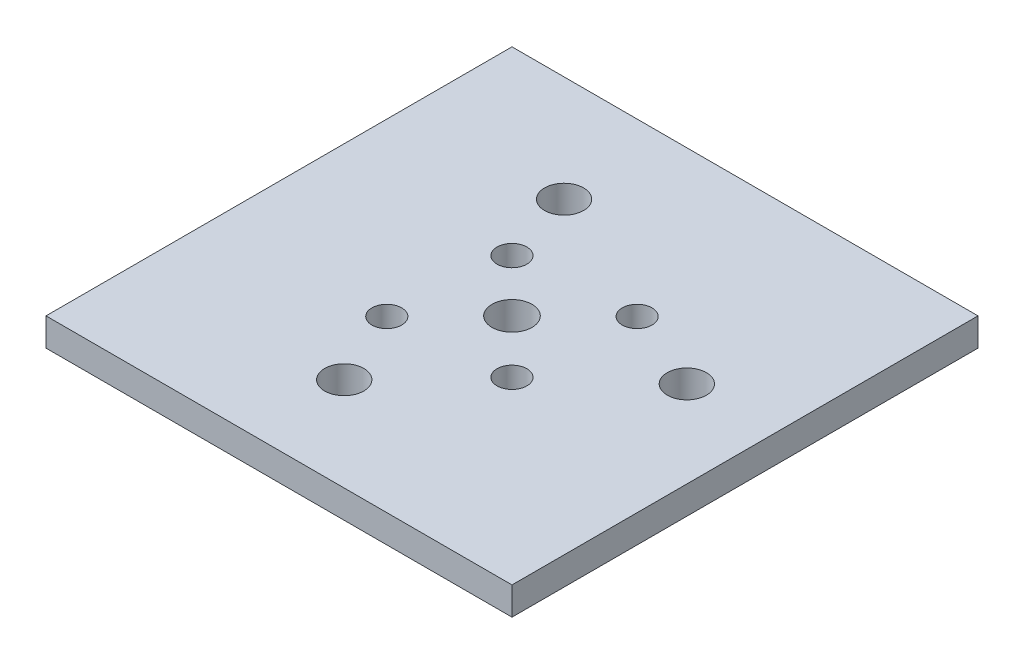
ISO-10303-21;
HEADER;
FILE_DESCRIPTION(('STEP AP214'),'2;1');
FILE_NAME('part.step','',(''),(''),'','','');
FILE_SCHEMA(('AUTOMOTIVE_DESIGN { 1 0 10303 214 1 1 1 1 }'));
ENDSEC;
DATA;
#1=APPLICATION_CONTEXT('core data for automotive mechanical design processes');
#2=APPLICATION_PROTOCOL_DEFINITION('international standard','automotive_design',2000,#1);
#3=PRODUCT_CONTEXT('',#1,'mechanical');
#4=PRODUCT('Part','Part','',(#3));
#5=PRODUCT_RELATED_PRODUCT_CATEGORY('part','',(#4));
#6=PRODUCT_DEFINITION_FORMATION('','',#4);
#7=PRODUCT_DEFINITION_CONTEXT('part definition',#1,'design');
#8=PRODUCT_DEFINITION('design','',#6,#7);
#9=PRODUCT_DEFINITION_SHAPE('','',#8);
#10=(LENGTH_UNIT() NAMED_UNIT(*) SI_UNIT(.MILLI.,.METRE.));
#11=(NAMED_UNIT(*) PLANE_ANGLE_UNIT() SI_UNIT($,.RADIAN.));
#12=(NAMED_UNIT(*) SI_UNIT($,.STERADIAN.) SOLID_ANGLE_UNIT());
#13=UNCERTAINTY_MEASURE_WITH_UNIT(LENGTH_MEASURE(1.E-05),#10,'distance_accuracy_value','');
#14=(GEOMETRIC_REPRESENTATION_CONTEXT(3) GLOBAL_UNCERTAINTY_ASSIGNED_CONTEXT((#13)) GLOBAL_UNIT_ASSIGNED_CONTEXT((#10,
#11,#12)) REPRESENTATION_CONTEXT('',''));
#15=CARTESIAN_POINT('',(0.,0.,0.));
#16=DIRECTION('',(0.,0.,1.));
#17=DIRECTION('',(1.,0.,0.));
#18=AXIS2_PLACEMENT_3D('',#15,#16,#17);
#19=CARTESIAN_POINT('',(25.,-3.,-25.));
#20=DIRECTION('',(1.,0.,0.));
#21=DIRECTION('',(0.,0.,-1.));
#22=AXIS2_PLACEMENT_3D('',#19,#20,#21);
#23=PLANE('',#22);
#24=DIRECTION('',(0.,0.,-1.));
#25=VECTOR('',#24,1.);
#26=CARTESIAN_POINT('',(25.,0.,-25.));
#27=LINE('',#26,#25);
#28=CARTESIAN_POINT('',(25.,0.,25.));
#29=VERTEX_POINT('',#28);
#30=CARTESIAN_POINT('',(25.,0.,-25.));
#31=VERTEX_POINT('',#30);
#32=EDGE_CURVE('E98',#29,#31,#27,.T.);
#33=ORIENTED_EDGE('',*,*,#32,.F.);
#34=DIRECTION('',(0.,1.,0.));
#35=VECTOR('',#34,1.);
#36=CARTESIAN_POINT('',(25.,-3.,25.));
#37=LINE('',#36,#35);
#38=CARTESIAN_POINT('',(25.,-3.,25.));
#39=VERTEX_POINT('',#38);
#40=EDGE_CURVE('E11',#39,#29,#37,.T.);
#41=ORIENTED_EDGE('',*,*,#40,.F.);
#42=DIRECTION('',(0.,0.,-1.));
#43=VECTOR('',#42,1.);
#44=CARTESIAN_POINT('',(25.,-3.,-25.));
#45=LINE('',#44,#43);
#46=CARTESIAN_POINT('',(25.,-3.,-25.));
#47=VERTEX_POINT('',#46);
#48=EDGE_CURVE('E91',#39,#47,#45,.T.);
#49=ORIENTED_EDGE('',*,*,#48,.T.);
#50=DIRECTION('',(0.,1.,0.));
#51=VECTOR('',#50,1.);
#52=CARTESIAN_POINT('',(25.,-3.,-25.));
#53=LINE('',#52,#51);
#54=EDGE_CURVE('E36',#47,#31,#53,.T.);
#55=ORIENTED_EDGE('',*,*,#54,.T.);
#56=EDGE_LOOP('',(#33,#41,#49,#55));
#57=FACE_BOUND('',#56,.T.);
#58=ADVANCED_FACE('F33',(#57),#23,.T.);
#59=CARTESIAN_POINT('',(-25.,-3.,25.));
#60=DIRECTION('',(0.,0.,1.));
#61=DIRECTION('',(1.,0.,0.));
#62=AXIS2_PLACEMENT_3D('',#59,#60,#61);
#63=PLANE('',#62);
#64=DIRECTION('',(1.,0.,0.));
#65=VECTOR('',#64,1.);
#66=CARTESIAN_POINT('',(-25.,0.,25.));
#67=LINE('',#66,#65);
#68=CARTESIAN_POINT('',(-25.,0.,25.));
#69=VERTEX_POINT('',#68);
#70=EDGE_CURVE('E93',#69,#29,#67,.T.);
#71=ORIENTED_EDGE('',*,*,#70,.F.);
#72=DIRECTION('',(0.,1.,0.));
#73=VECTOR('',#72,1.);
#74=CARTESIAN_POINT('',(-25.,-3.,25.));
#75=LINE('',#74,#73);
#76=CARTESIAN_POINT('',(-25.,-3.,25.));
#77=VERTEX_POINT('',#76);
#78=EDGE_CURVE('E42',#77,#69,#75,.T.);
#79=ORIENTED_EDGE('',*,*,#78,.F.);
#80=DIRECTION('',(1.,0.,0.));
#81=VECTOR('',#80,1.);
#82=CARTESIAN_POINT('',(-25.,-3.,25.));
#83=LINE('',#82,#81);
#84=EDGE_CURVE('E88',#77,#39,#83,.T.);
#85=ORIENTED_EDGE('',*,*,#84,.T.);
#86=ORIENTED_EDGE('',*,*,#40,.T.);
#87=EDGE_LOOP('',(#71,#79,#85,#86));
#88=FACE_BOUND('',#87,.T.);
#89=ADVANCED_FACE('F109',(#88),#63,.T.);
#90=CARTESIAN_POINT('',(-25.,-3.,-25.));
#91=DIRECTION('',(-1.,0.,0.));
#92=DIRECTION('',(0.,0.,1.));
#93=AXIS2_PLACEMENT_3D('',#90,#91,#92);
#94=PLANE('',#93);
#95=DIRECTION('',(0.,0.,1.));
#96=VECTOR('',#95,1.);
#97=CARTESIAN_POINT('',(-25.,0.,-25.));
#98=LINE('',#97,#96);
#99=CARTESIAN_POINT('',(-25.,0.,-25.));
#100=VERTEX_POINT('',#99);
#101=EDGE_CURVE('E83',#100,#69,#98,.T.);
#102=ORIENTED_EDGE('',*,*,#101,.F.);
#103=DIRECTION('',(0.,1.,0.));
#104=VECTOR('',#103,1.);
#105=CARTESIAN_POINT('',(-25.,-3.,-25.));
#106=LINE('',#105,#104);
#107=CARTESIAN_POINT('',(-25.,-3.,-25.));
#108=VERTEX_POINT('',#107);
#109=EDGE_CURVE('E78',#108,#100,#106,.T.);
#110=ORIENTED_EDGE('',*,*,#109,.F.);
#111=DIRECTION('',(0.,0.,1.));
#112=VECTOR('',#111,1.);
#113=CARTESIAN_POINT('',(-25.,-3.,-25.));
#114=LINE('',#113,#112);
#115=EDGE_CURVE('E81',#108,#77,#114,.T.);
#116=ORIENTED_EDGE('',*,*,#115,.T.);
#117=ORIENTED_EDGE('',*,*,#78,.T.);
#118=EDGE_LOOP('',(#102,#110,#116,#117));
#119=FACE_BOUND('',#118,.T.);
#120=ADVANCED_FACE('F80',(#119),#94,.T.);
#121=CARTESIAN_POINT('',(-25.,-3.,-25.));
#122=DIRECTION('',(0.,0.,-1.));
#123=DIRECTION('',(-1.,0.,0.));
#124=AXIS2_PLACEMENT_3D('',#121,#122,#123);
#125=PLANE('',#124);
#126=DIRECTION('',(-1.,0.,0.));
#127=VECTOR('',#126,1.);
#128=CARTESIAN_POINT('',(-25.,0.,-25.));
#129=LINE('',#128,#127);
#130=EDGE_CURVE('E101',#31,#100,#129,.T.);
#131=ORIENTED_EDGE('',*,*,#130,.F.);
#132=ORIENTED_EDGE('',*,*,#54,.F.);
#133=DIRECTION('',(-1.,0.,0.));
#134=VECTOR('',#133,1.);
#135=CARTESIAN_POINT('',(-25.,-3.,-25.));
#136=LINE('',#135,#134);
#137=EDGE_CURVE('E87',#47,#108,#136,.T.);
#138=ORIENTED_EDGE('',*,*,#137,.T.);
#139=ORIENTED_EDGE('',*,*,#109,.T.);
#140=EDGE_LOOP('',(#131,#132,#138,#139));
#141=FACE_BOUND('',#140,.T.);
#142=ADVANCED_FACE('F90',(#141),#125,.T.);
#143=CARTESIAN_POINT('',(0.,-3.,0.));
#144=DIRECTION('',(0.,1.,0.));
#145=DIRECTION('',(0.,0.,1.));
#146=AXIS2_PLACEMENT_3D('',#143,#144,#145);
#147=PLANE('',#146);
#148=CARTESIAN_POINT('',(-8.04582800742343,-3.,-13.6336553986151));
#149=DIRECTION('',(0.,1.,0.));
#150=DIRECTION('',(0.,0.,1.));
#151=AXIS2_PLACEMENT_3D('',#148,#149,#150);
#152=CIRCLE('',#151,2.1);
#153=CARTESIAN_POINT('',(-8.04582800742343,-3.,-11.5336553986151));
#154=VERTEX_POINT('',#153);
#155=EDGE_CURVE('E166',#154,#154,#152,.T.);
#156=ORIENTED_EDGE('',*,*,#155,.T.);
#157=EDGE_LOOP('',(#156));
#158=FACE_BOUND('',#157,.T.);
#159=CARTESIAN_POINT('',(-3.06433366505885,-3.,14.9352912763498));
#160=DIRECTION('',(0.,1.,0.));
#161=DIRECTION('',(0.,0.,1.));
#162=AXIS2_PLACEMENT_3D('',#159,#160,#161);
#163=CIRCLE('',#162,2.1);
#164=CARTESIAN_POINT('',(-3.06433366505885,-3.,17.0352912763498));
#165=VERTEX_POINT('',#164);
#166=EDGE_CURVE('E174',#165,#165,#163,.T.);
#167=ORIENTED_EDGE('',*,*,#166,.T.);
#168=EDGE_LOOP('',(#167));
#169=FACE_BOUND('',#168,.T.);
#170=CARTESIAN_POINT('',(15.7053794303922,-3.,-3.05631427497477));
#171=DIRECTION('',(0.,1.,0.));
#172=DIRECTION('',(0.,0.,1.));
#173=AXIS2_PLACEMENT_3D('',#170,#171,#172);
#174=CIRCLE('',#173,2.1);
#175=CARTESIAN_POINT('',(15.7053794303922,-3.,-0.956314274974772));
#176=VERTEX_POINT('',#175);
#177=EDGE_CURVE('E180',#176,#176,#174,.T.);
#178=ORIENTED_EDGE('',*,*,#177,.T.);
#179=EDGE_LOOP('',(#178));
#180=FACE_BOUND('',#179,.T.);
#181=CARTESIAN_POINT('',(5.70835381113977,-3.,5.7129218255081));
#182=DIRECTION('',(0.,1.,0.));
#183=DIRECTION('',(0.,0.,1.));
#184=AXIS2_PLACEMENT_3D('',#181,#182,#183);
#185=CIRCLE('',#184,1.6);
#186=CARTESIAN_POINT('',(5.70835381113977,-3.,7.3129218255081));
#187=VERTEX_POINT('',#186);
#188=EDGE_CURVE('E186',#187,#187,#185,.T.);
#189=ORIENTED_EDGE('',*,*,#188,.T.);
#190=EDGE_LOOP('',(#189));
#191=FACE_BOUND('',#190,.T.);
#192=CARTESIAN_POINT('',(-5.60164618886023,-3.,-5.5970781744919));
#193=DIRECTION('',(0.,1.,0.));
#194=DIRECTION('',(0.,0.,1.));
#195=AXIS2_PLACEMENT_3D('',#192,#193,#194);
#196=CIRCLE('',#195,1.6);
#197=CARTESIAN_POINT('',(-5.60164618886023,-3.,-3.9970781744919));
#198=VERTEX_POINT('',#197);
#199=EDGE_CURVE('E192',#198,#198,#196,.T.);
#200=ORIENTED_EDGE('',*,*,#199,.T.);
#201=EDGE_LOOP('',(#200));
#202=FACE_BOUND('',#201,.T.);
#203=CARTESIAN_POINT('',(-6.66164618886023,-3.,6.7729218255081));
#204=DIRECTION('',(0.,1.,0.));
#205=DIRECTION('',(0.,0.,1.));
#206=AXIS2_PLACEMENT_3D('',#203,#204,#205);
#207=CIRCLE('',#206,1.6);
#208=CARTESIAN_POINT('',(-6.66164618886023,-3.,8.3729218255081));
#209=VERTEX_POINT('',#208);
#210=EDGE_CURVE('E198',#209,#209,#207,.T.);
#211=ORIENTED_EDGE('',*,*,#210,.T.);
#212=EDGE_LOOP('',(#211));
#213=FACE_BOUND('',#212,.T.);
#214=CARTESIAN_POINT('',(6.76835381113977,-3.,-6.6570781744919));
#215=DIRECTION('',(0.,1.,0.));
#216=DIRECTION('',(0.,0.,1.));
#217=AXIS2_PLACEMENT_3D('',#214,#215,#216);
#218=CIRCLE('',#217,1.6);
#219=CARTESIAN_POINT('',(6.76835381113977,-3.,-5.0570781744919));
#220=VERTEX_POINT('',#219);
#221=EDGE_CURVE('E204',#220,#220,#218,.T.);
#222=ORIENTED_EDGE('',*,*,#221,.T.);
#223=EDGE_LOOP('',(#222));
#224=FACE_BOUND('',#223,.T.);
#225=CARTESIAN_POINT('',(0.,-3.,0.));
#226=DIRECTION('',(0.,1.,0.));
#227=DIRECTION('',(0.,0.,1.));
#228=AXIS2_PLACEMENT_3D('',#225,#226,#227);
#229=CIRCLE('',#228,2.15);
#230=CARTESIAN_POINT('',(0.,-3.,2.15));
#231=VERTEX_POINT('',#230);
#232=EDGE_CURVE('E102',#231,#231,#229,.T.);
#233=ORIENTED_EDGE('',*,*,#232,.T.);
#234=EDGE_LOOP('',(#233));
#235=FACE_BOUND('',#234,.T.);
#236=ORIENTED_EDGE('',*,*,#48,.F.);
#237=ORIENTED_EDGE('',*,*,#84,.F.);
#238=ORIENTED_EDGE('',*,*,#115,.F.);
#239=ORIENTED_EDGE('',*,*,#137,.F.);
#240=EDGE_LOOP('',(#236,#237,#238,#239));
#241=FACE_BOUND('',#240,.T.);
#242=ADVANCED_FACE('F86',(#158,#169,#180,#191,#202,#213,#224,#235,#241),#147,.F.);
#243=CARTESIAN_POINT('',(0.,0.,0.));
#244=DIRECTION('',(0.,1.,0.));
#245=DIRECTION('',(0.,0.,1.));
#246=AXIS2_PLACEMENT_3D('',#243,#244,#245);
#247=PLANE('',#246);
#248=CARTESIAN_POINT('',(-8.04582800742343,0.,-13.6336553986151));
#249=DIRECTION('',(0.,1.,0.));
#250=DIRECTION('',(0.,0.,1.));
#251=AXIS2_PLACEMENT_3D('',#248,#249,#250);
#252=CIRCLE('',#251,2.1);
#253=CARTESIAN_POINT('',(-8.04582800742343,0.,-11.5336553986151));
#254=VERTEX_POINT('',#253);
#255=EDGE_CURVE('E169',#254,#254,#252,.T.);
#256=ORIENTED_EDGE('',*,*,#255,.F.);
#257=EDGE_LOOP('',(#256));
#258=FACE_BOUND('',#257,.T.);
#259=CARTESIAN_POINT('',(-3.06433366505885,0.,14.9352912763498));
#260=DIRECTION('',(0.,1.,0.));
#261=DIRECTION('',(0.,0.,1.));
#262=AXIS2_PLACEMENT_3D('',#259,#260,#261);
#263=CIRCLE('',#262,2.1);
#264=CARTESIAN_POINT('',(-3.06433366505885,0.,17.0352912763498));
#265=VERTEX_POINT('',#264);
#266=EDGE_CURVE('E171',#265,#265,#263,.T.);
#267=ORIENTED_EDGE('',*,*,#266,.F.);
#268=EDGE_LOOP('',(#267));
#269=FACE_BOUND('',#268,.T.);
#270=CARTESIAN_POINT('',(15.7053794303922,0.,-3.05631427497477));
#271=DIRECTION('',(0.,1.,0.));
#272=DIRECTION('',(0.,0.,1.));
#273=AXIS2_PLACEMENT_3D('',#270,#271,#272);
#274=CIRCLE('',#273,2.1);
#275=CARTESIAN_POINT('',(15.7053794303922,0.,-0.956314274974772));
#276=VERTEX_POINT('',#275);
#277=EDGE_CURVE('E177',#276,#276,#274,.T.);
#278=ORIENTED_EDGE('',*,*,#277,.F.);
#279=EDGE_LOOP('',(#278));
#280=FACE_BOUND('',#279,.T.);
#281=CARTESIAN_POINT('',(5.70835381113977,0.,5.7129218255081));
#282=DIRECTION('',(0.,1.,0.));
#283=DIRECTION('',(0.,0.,1.));
#284=AXIS2_PLACEMENT_3D('',#281,#282,#283);
#285=CIRCLE('',#284,1.6);
#286=CARTESIAN_POINT('',(5.70835381113977,0.,7.3129218255081));
#287=VERTEX_POINT('',#286);
#288=EDGE_CURVE('E183',#287,#287,#285,.T.);
#289=ORIENTED_EDGE('',*,*,#288,.F.);
#290=EDGE_LOOP('',(#289));
#291=FACE_BOUND('',#290,.T.);
#292=CARTESIAN_POINT('',(-5.60164618886023,0.,-5.5970781744919));
#293=DIRECTION('',(0.,1.,0.));
#294=DIRECTION('',(0.,0.,1.));
#295=AXIS2_PLACEMENT_3D('',#292,#293,#294);
#296=CIRCLE('',#295,1.6);
#297=CARTESIAN_POINT('',(-5.60164618886023,0.,-3.9970781744919));
#298=VERTEX_POINT('',#297);
#299=EDGE_CURVE('E189',#298,#298,#296,.T.);
#300=ORIENTED_EDGE('',*,*,#299,.F.);
#301=EDGE_LOOP('',(#300));
#302=FACE_BOUND('',#301,.T.);
#303=CARTESIAN_POINT('',(-6.66164618886023,0.,6.7729218255081));
#304=DIRECTION('',(0.,1.,0.));
#305=DIRECTION('',(0.,0.,1.));
#306=AXIS2_PLACEMENT_3D('',#303,#304,#305);
#307=CIRCLE('',#306,1.6);
#308=CARTESIAN_POINT('',(-6.66164618886023,0.,8.3729218255081));
#309=VERTEX_POINT('',#308);
#310=EDGE_CURVE('E195',#309,#309,#307,.T.);
#311=ORIENTED_EDGE('',*,*,#310,.F.);
#312=EDGE_LOOP('',(#311));
#313=FACE_BOUND('',#312,.T.);
#314=CARTESIAN_POINT('',(6.76835381113977,0.,-6.6570781744919));
#315=DIRECTION('',(0.,1.,0.));
#316=DIRECTION('',(0.,0.,1.));
#317=AXIS2_PLACEMENT_3D('',#314,#315,#316);
#318=CIRCLE('',#317,1.6);
#319=CARTESIAN_POINT('',(6.76835381113977,0.,-5.0570781744919));
#320=VERTEX_POINT('',#319);
#321=EDGE_CURVE('E201',#320,#320,#318,.T.);
#322=ORIENTED_EDGE('',*,*,#321,.F.);
#323=EDGE_LOOP('',(#322));
#324=FACE_BOUND('',#323,.T.);
#325=CARTESIAN_POINT('',(0.,0.,0.));
#326=DIRECTION('',(0.,1.,0.));
#327=DIRECTION('',(0.,0.,1.));
#328=AXIS2_PLACEMENT_3D('',#325,#326,#327);
#329=CIRCLE('',#328,2.15);
#330=CARTESIAN_POINT('',(0.,0.,2.15));
#331=VERTEX_POINT('',#330);
#332=EDGE_CURVE('E207',#331,#331,#329,.T.);
#333=ORIENTED_EDGE('',*,*,#332,.F.);
#334=EDGE_LOOP('',(#333));
#335=FACE_BOUND('',#334,.T.);
#336=ORIENTED_EDGE('',*,*,#32,.T.);
#337=ORIENTED_EDGE('',*,*,#130,.T.);
#338=ORIENTED_EDGE('',*,*,#101,.T.);
#339=ORIENTED_EDGE('',*,*,#70,.T.);
#340=EDGE_LOOP('',(#336,#337,#338,#339));
#341=FACE_BOUND('',#340,.T.);
#342=ADVANCED_FACE('F108',(#258,#269,#280,#291,#302,#313,#324,#335,#341),#247,.T.);
#343=CARTESIAN_POINT('',(0.,-3.,0.));
#344=DIRECTION('',(0.,1.,0.));
#345=DIRECTION('',(0.,0.,1.));
#346=AXIS2_PLACEMENT_3D('',#343,#344,#345);
#347=CYLINDRICAL_SURFACE('',#346,2.15);
#348=ORIENTED_EDGE('',*,*,#232,.F.);
#349=EDGE_LOOP('',(#348));
#350=FACE_BOUND('',#349,.T.);
#351=ORIENTED_EDGE('',*,*,#332,.T.);
#352=EDGE_LOOP('',(#351));
#353=FACE_BOUND('',#352,.T.);
#354=ADVANCED_FACE('F127',(#350,#353),#347,.F.);
#355=CARTESIAN_POINT('',(6.76835381113977,-3.,-6.6570781744919));
#356=DIRECTION('',(0.,1.,0.));
#357=DIRECTION('',(0.,0.,1.));
#358=AXIS2_PLACEMENT_3D('',#355,#356,#357);
#359=CYLINDRICAL_SURFACE('',#358,1.6);
#360=ORIENTED_EDGE('',*,*,#221,.F.);
#361=EDGE_LOOP('',(#360));
#362=FACE_BOUND('',#361,.T.);
#363=ORIENTED_EDGE('',*,*,#321,.T.);
#364=EDGE_LOOP('',(#363));
#365=FACE_BOUND('',#364,.T.);
#366=ADVANCED_FACE('F134',(#362,#365),#359,.F.);
#367=CARTESIAN_POINT('',(-6.66164618886023,-3.,6.7729218255081));
#368=DIRECTION('',(0.,1.,0.));
#369=DIRECTION('',(0.,0.,1.));
#370=AXIS2_PLACEMENT_3D('',#367,#368,#369);
#371=CYLINDRICAL_SURFACE('',#370,1.6);
#372=ORIENTED_EDGE('',*,*,#210,.F.);
#373=EDGE_LOOP('',(#372));
#374=FACE_BOUND('',#373,.T.);
#375=ORIENTED_EDGE('',*,*,#310,.T.);
#376=EDGE_LOOP('',(#375));
#377=FACE_BOUND('',#376,.T.);
#378=ADVANCED_FACE('F138',(#374,#377),#371,.F.);
#379=CARTESIAN_POINT('',(-5.60164618886023,-3.,-5.5970781744919));
#380=DIRECTION('',(0.,1.,0.));
#381=DIRECTION('',(0.,0.,1.));
#382=AXIS2_PLACEMENT_3D('',#379,#380,#381);
#383=CYLINDRICAL_SURFACE('',#382,1.6);
#384=ORIENTED_EDGE('',*,*,#199,.F.);
#385=EDGE_LOOP('',(#384));
#386=FACE_BOUND('',#385,.T.);
#387=ORIENTED_EDGE('',*,*,#299,.T.);
#388=EDGE_LOOP('',(#387));
#389=FACE_BOUND('',#388,.T.);
#390=ADVANCED_FACE('F142',(#386,#389),#383,.F.);
#391=CARTESIAN_POINT('',(5.70835381113977,-3.,5.7129218255081));
#392=DIRECTION('',(0.,1.,0.));
#393=DIRECTION('',(0.,0.,1.));
#394=AXIS2_PLACEMENT_3D('',#391,#392,#393);
#395=CYLINDRICAL_SURFACE('',#394,1.6);
#396=ORIENTED_EDGE('',*,*,#188,.F.);
#397=EDGE_LOOP('',(#396));
#398=FACE_BOUND('',#397,.T.);
#399=ORIENTED_EDGE('',*,*,#288,.T.);
#400=EDGE_LOOP('',(#399));
#401=FACE_BOUND('',#400,.T.);
#402=ADVANCED_FACE('F146',(#398,#401),#395,.F.);
#403=CARTESIAN_POINT('',(15.7053794303922,-3.,-3.05631427497477));
#404=DIRECTION('',(0.,1.,0.));
#405=DIRECTION('',(0.,0.,1.));
#406=AXIS2_PLACEMENT_3D('',#403,#404,#405);
#407=CYLINDRICAL_SURFACE('',#406,2.1);
#408=ORIENTED_EDGE('',*,*,#177,.F.);
#409=EDGE_LOOP('',(#408));
#410=FACE_BOUND('',#409,.T.);
#411=ORIENTED_EDGE('',*,*,#277,.T.);
#412=EDGE_LOOP('',(#411));
#413=FACE_BOUND('',#412,.T.);
#414=ADVANCED_FACE('F150',(#410,#413),#407,.F.);
#415=CARTESIAN_POINT('',(-3.06433366505885,-3.,14.9352912763498));
#416=DIRECTION('',(0.,1.,0.));
#417=DIRECTION('',(0.,0.,1.));
#418=AXIS2_PLACEMENT_3D('',#415,#416,#417);
#419=CYLINDRICAL_SURFACE('',#418,2.1);
#420=ORIENTED_EDGE('',*,*,#166,.F.);
#421=EDGE_LOOP('',(#420));
#422=FACE_BOUND('',#421,.T.);
#423=ORIENTED_EDGE('',*,*,#266,.T.);
#424=EDGE_LOOP('',(#423));
#425=FACE_BOUND('',#424,.T.);
#426=ADVANCED_FACE('F154',(#422,#425),#419,.F.);
#427=CARTESIAN_POINT('',(-8.04582800742343,-3.,-13.6336553986151));
#428=DIRECTION('',(0.,1.,0.));
#429=DIRECTION('',(0.,0.,1.));
#430=AXIS2_PLACEMENT_3D('',#427,#428,#429);
#431=CYLINDRICAL_SURFACE('',#430,2.1);
#432=ORIENTED_EDGE('',*,*,#155,.F.);
#433=EDGE_LOOP('',(#432));
#434=FACE_BOUND('',#433,.T.);
#435=ORIENTED_EDGE('',*,*,#255,.T.);
#436=EDGE_LOOP('',(#435));
#437=FACE_BOUND('',#436,.T.);
#438=ADVANCED_FACE('F158',(#434,#437),#431,.F.);
#439=CLOSED_SHELL('',(#58,#89,#120,#142,#242,#342,#354,#366,#378,#390,#402,#414,#426,#438));
#440=MANIFOLD_SOLID_BREP('B2',#439);
#441=ADVANCED_BREP_SHAPE_REPRESENTATION('',(#18,#440),#14);
#442=SHAPE_DEFINITION_REPRESENTATION(#9,#441);
ENDSEC;
END-ISO-10303-21;
